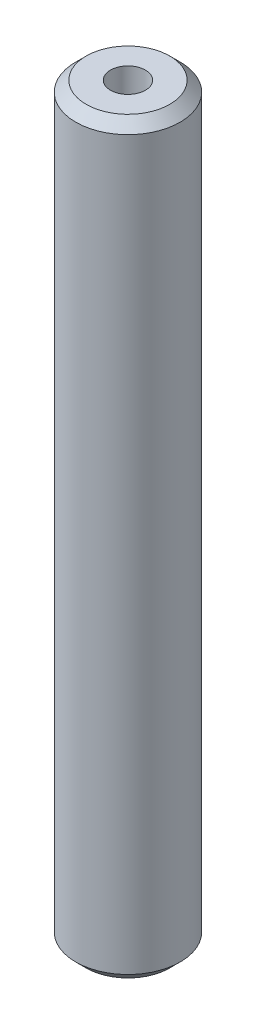
ISO-10303-21;
HEADER;
FILE_DESCRIPTION(('STEP AP214'),'2;1');
FILE_NAME('part.step','',(''),(''),'','','');
FILE_SCHEMA(('AUTOMOTIVE_DESIGN { 1 0 10303 214 1 1 1 1 }'));
ENDSEC;
DATA;
#1=APPLICATION_CONTEXT('core data for automotive mechanical design processes');
#2=APPLICATION_PROTOCOL_DEFINITION('international standard','automotive_design',2000,#1);
#3=PRODUCT_CONTEXT('',#1,'mechanical');
#4=PRODUCT('Part','Part','',(#3));
#5=PRODUCT_RELATED_PRODUCT_CATEGORY('part','',(#4));
#6=PRODUCT_DEFINITION_FORMATION('','',#4);
#7=PRODUCT_DEFINITION_CONTEXT('part definition',#1,'design');
#8=PRODUCT_DEFINITION('design','',#6,#7);
#9=PRODUCT_DEFINITION_SHAPE('','',#8);
#10=(LENGTH_UNIT() NAMED_UNIT(*) SI_UNIT(.MILLI.,.METRE.));
#11=(NAMED_UNIT(*) PLANE_ANGLE_UNIT() SI_UNIT($,.RADIAN.));
#12=(NAMED_UNIT(*) SI_UNIT($,.STERADIAN.) SOLID_ANGLE_UNIT());
#13=UNCERTAINTY_MEASURE_WITH_UNIT(LENGTH_MEASURE(1.E-05),#10,'distance_accuracy_value','');
#14=(GEOMETRIC_REPRESENTATION_CONTEXT(3) GLOBAL_UNCERTAINTY_ASSIGNED_CONTEXT((#13)) GLOBAL_UNIT_ASSIGNED_CONTEXT((#10,
#11,#12)) REPRESENTATION_CONTEXT('',''));
#15=CARTESIAN_POINT('',(0.,0.,0.));
#16=DIRECTION('',(0.,0.,1.));
#17=DIRECTION('',(1.,0.,0.));
#18=AXIS2_PLACEMENT_3D('',#15,#16,#17);
#19=CARTESIAN_POINT('',(0.,143.357903293885,0.));
#20=DIRECTION('',(0.,-1.,0.));
#21=DIRECTION('',(0.,0.,-1.));
#22=AXIS2_PLACEMENT_3D('',#19,#20,#21);
#23=CYLINDRICAL_SURFACE('',#22,10.);
#24=CARTESIAN_POINT('',(0.,141.377446230245,0.));
#25=DIRECTION('',(0.,1.,0.));
#26=DIRECTION('',(0.,0.,1.));
#27=AXIS2_PLACEMENT_3D('',#24,#25,#26);
#28=CIRCLE('',#27,10.);
#29=CARTESIAN_POINT('',(0.,141.377446230245,10.));
#30=VERTEX_POINT('',#29);
#31=EDGE_CURVE('E50',#30,#30,#28,.F.);
#32=ORIENTED_EDGE('',*,*,#31,.T.);
#33=EDGE_LOOP('',(#32));
#34=FACE_BOUND('',#33,.T.);
#35=CARTESIAN_POINT('',(0.,1.9804570636402,0.));
#36=DIRECTION('',(0.,1.,0.));
#37=DIRECTION('',(0.,0.,1.));
#38=AXIS2_PLACEMENT_3D('',#35,#36,#37);
#39=CIRCLE('',#38,10.);
#40=CARTESIAN_POINT('',(0.,1.9804570636402,10.));
#41=VERTEX_POINT('',#40);
#42=EDGE_CURVE('E51',#41,#41,#39,.T.);
#43=ORIENTED_EDGE('',*,*,#42,.T.);
#44=EDGE_LOOP('',(#43));
#45=FACE_BOUND('',#44,.T.);
#46=ADVANCED_FACE('F39',(#34,#45),#23,.T.);
#47=CARTESIAN_POINT('',(0.,143.357903293885,0.));
#48=DIRECTION('',(0.,1.,0.));
#49=DIRECTION('',(0.,0.,1.));
#50=AXIS2_PLACEMENT_3D('',#47,#48,#49);
#51=PLANE('',#50);
#52=CARTESIAN_POINT('',(0.,143.357903293885,0.));
#53=DIRECTION('',(0.,1.,0.));
#54=DIRECTION('',(0.,0.,1.));
#55=AXIS2_PLACEMENT_3D('',#52,#53,#54);
#56=CIRCLE('',#55,8.01954293635977);
#57=CARTESIAN_POINT('',(0.,143.357903293885,8.01954293635977));
#58=VERTEX_POINT('',#57);
#59=EDGE_CURVE('E54',#58,#58,#56,.T.);
#60=ORIENTED_EDGE('',*,*,#59,.T.);
#61=EDGE_LOOP('',(#60));
#62=FACE_BOUND('',#61,.T.);
#63=CARTESIAN_POINT('',(0.,143.357903293885,0.));
#64=DIRECTION('',(0.,1.,0.));
#65=DIRECTION('',(0.,0.,1.));
#66=AXIS2_PLACEMENT_3D('',#63,#64,#65);
#67=CIRCLE('',#66,3.34920161613808);
#68=CARTESIAN_POINT('',(0.,143.357903293885,3.34920161613808));
#69=VERTEX_POINT('',#68);
#70=EDGE_CURVE('E58',#69,#69,#67,.T.);
#71=ORIENTED_EDGE('',*,*,#70,.F.);
#72=EDGE_LOOP('',(#71));
#73=FACE_BOUND('',#72,.T.);
#74=ADVANCED_FACE('F69',(#62,#73),#51,.T.);
#75=CARTESIAN_POINT('',(0.,0.,0.));
#76=DIRECTION('',(0.,1.,0.));
#77=DIRECTION('',(0.,0.,1.));
#78=AXIS2_PLACEMENT_3D('',#75,#76,#77);
#79=PLANE('',#78);
#80=CARTESIAN_POINT('',(0.,0.,0.));
#81=DIRECTION('',(0.,1.,0.));
#82=DIRECTION('',(0.,0.,1.));
#83=AXIS2_PLACEMENT_3D('',#80,#81,#82);
#84=CIRCLE('',#83,8.01954293635979);
#85=CARTESIAN_POINT('',(0.,0.,8.01954293635979));
#86=VERTEX_POINT('',#85);
#87=EDGE_CURVE('E10',#86,#86,#84,.F.);
#88=ORIENTED_EDGE('',*,*,#87,.T.);
#89=EDGE_LOOP('',(#88));
#90=FACE_BOUND('',#89,.T.);
#91=CARTESIAN_POINT('',(0.,0.,0.));
#92=DIRECTION('',(0.,1.,0.));
#93=DIRECTION('',(0.,0.,1.));
#94=AXIS2_PLACEMENT_3D('',#91,#92,#93);
#95=CIRCLE('',#94,3.34920161613808);
#96=CARTESIAN_POINT('',(0.,0.,3.34920161613808));
#97=VERTEX_POINT('',#96);
#98=EDGE_CURVE('E63',#97,#97,#95,.T.);
#99=ORIENTED_EDGE('',*,*,#98,.T.);
#100=EDGE_LOOP('',(#99));
#101=FACE_BOUND('',#100,.T.);
#102=ADVANCED_FACE('F75',(#90,#101),#79,.F.);
#103=CARTESIAN_POINT('',(0.,143.357903293885,0.));
#104=DIRECTION('',(0.,-1.,0.));
#105=DIRECTION('',(0.,0.,-1.));
#106=AXIS2_PLACEMENT_3D('',#103,#104,#105);
#107=CYLINDRICAL_SURFACE('',#106,3.34920161613808);
#108=ORIENTED_EDGE('',*,*,#70,.T.);
#109=EDGE_LOOP('',(#108));
#110=FACE_BOUND('',#109,.T.);
#111=ORIENTED_EDGE('',*,*,#98,.F.);
#112=EDGE_LOOP('',(#111));
#113=FACE_BOUND('',#112,.T.);
#114=ADVANCED_FACE('F70',(#110,#113),#107,.F.);
#115=CARTESIAN_POINT('',(0.,143.357903293885,0.));
#116=DIRECTION('',(0.,-1.,0.));
#117=DIRECTION('',(0.,0.,-1.));
#118=AXIS2_PLACEMENT_3D('',#115,#116,#117);
#119=CONICAL_SURFACE('',#118,8.01954293635977,0.78539816339745);
#120=ORIENTED_EDGE('',*,*,#31,.F.);
#121=EDGE_LOOP('',(#120));
#122=FACE_BOUND('',#121,.T.);
#123=ORIENTED_EDGE('',*,*,#59,.F.);
#124=EDGE_LOOP('',(#123));
#125=FACE_BOUND('',#124,.T.);
#126=ADVANCED_FACE('F81',(#122,#125),#119,.T.);
#127=CARTESIAN_POINT('',(0.,1.9804570636402,0.));
#128=DIRECTION('',(0.,1.,0.));
#129=DIRECTION('',(0.,0.,1.));
#130=AXIS2_PLACEMENT_3D('',#127,#128,#129);
#131=CONICAL_SURFACE('',#130,10.,0.785398163397453);
#132=ORIENTED_EDGE('',*,*,#87,.F.);
#133=EDGE_LOOP('',(#132));
#134=FACE_BOUND('',#133,.T.);
#135=ORIENTED_EDGE('',*,*,#42,.F.);
#136=EDGE_LOOP('',(#135));
#137=FACE_BOUND('',#136,.T.);
#138=ADVANCED_FACE('F45',(#134,#137),#131,.T.);
#139=CLOSED_SHELL('',(#46,#74,#102,#114,#126,#138));
#140=MANIFOLD_SOLID_BREP('B2',#139);
#141=ADVANCED_BREP_SHAPE_REPRESENTATION('',(#18,#140),#14);
#142=SHAPE_DEFINITION_REPRESENTATION(#9,#141);
ENDSEC;
END-ISO-10303-21;
